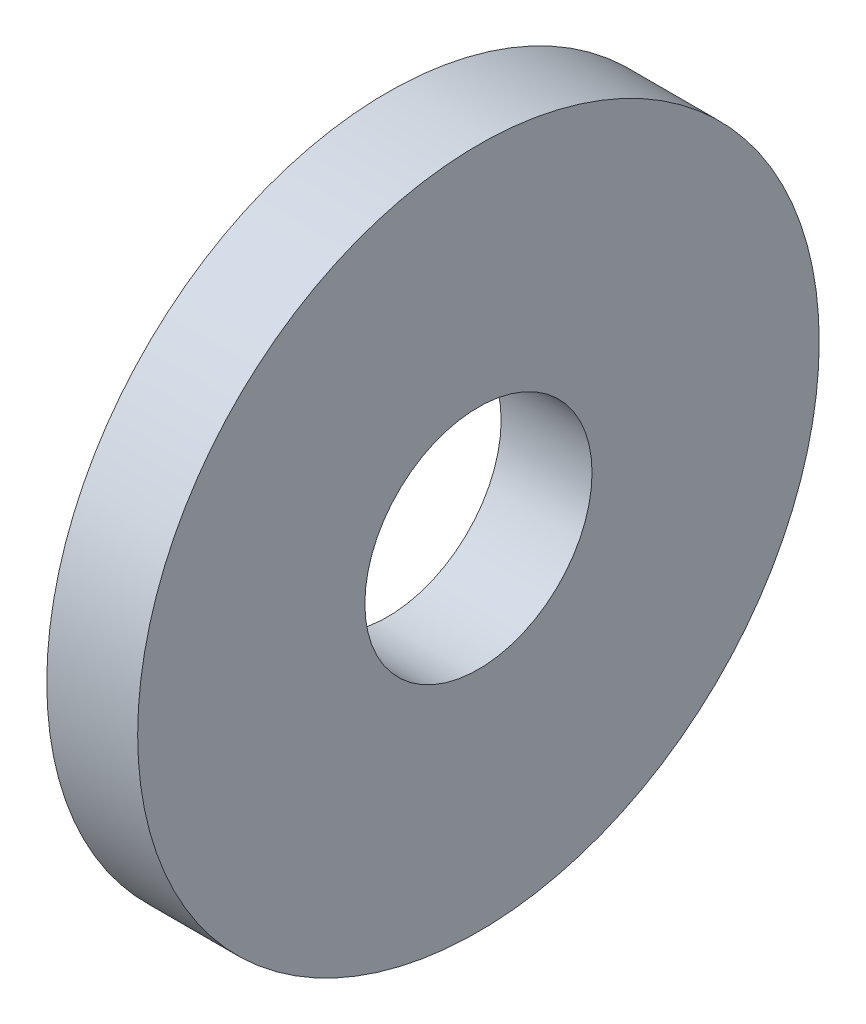
ISO-10303-21;
HEADER;
FILE_DESCRIPTION(('STEP AP214'),'2;1');
FILE_NAME('part.step','',(''),(''),'','','');
FILE_SCHEMA(('AUTOMOTIVE_DESIGN { 1 0 10303 214 1 1 1 1 }'));
ENDSEC;
DATA;
#1=APPLICATION_CONTEXT('core data for automotive mechanical design processes');
#2=APPLICATION_PROTOCOL_DEFINITION('international standard','automotive_design',2000,#1);
#3=PRODUCT_CONTEXT('',#1,'mechanical');
#4=PRODUCT('Part','Part','',(#3));
#5=PRODUCT_RELATED_PRODUCT_CATEGORY('part','',(#4));
#6=PRODUCT_DEFINITION_FORMATION('','',#4);
#7=PRODUCT_DEFINITION_CONTEXT('part definition',#1,'design');
#8=PRODUCT_DEFINITION('design','',#6,#7);
#9=PRODUCT_DEFINITION_SHAPE('','',#8);
#10=(LENGTH_UNIT() NAMED_UNIT(*) SI_UNIT(.MILLI.,.METRE.));
#11=(NAMED_UNIT(*) PLANE_ANGLE_UNIT() SI_UNIT($,.RADIAN.));
#12=(NAMED_UNIT(*) SI_UNIT($,.STERADIAN.) SOLID_ANGLE_UNIT());
#13=UNCERTAINTY_MEASURE_WITH_UNIT(LENGTH_MEASURE(1.E-05),#10,'distance_accuracy_value','');
#14=(GEOMETRIC_REPRESENTATION_CONTEXT(3) GLOBAL_UNCERTAINTY_ASSIGNED_CONTEXT((#13)) GLOBAL_UNIT_ASSIGNED_CONTEXT((#10,
#11,#12)) REPRESENTATION_CONTEXT('',''));
#15=CARTESIAN_POINT('',(0.,0.,0.));
#16=DIRECTION('',(0.,0.,1.));
#17=DIRECTION('',(1.,0.,0.));
#18=AXIS2_PLACEMENT_3D('',#15,#16,#17);
#19=CARTESIAN_POINT('',(4.,0.,0.));
#20=DIRECTION('',(1.,0.,0.));
#21=DIRECTION('',(0.,0.,-1.));
#22=AXIS2_PLACEMENT_3D('',#19,#20,#21);
#23=PLANE('',#22);
#24=CARTESIAN_POINT('',(4.,0.,0.));
#25=DIRECTION('',(1.,0.,0.));
#26=DIRECTION('',(0.,0.,-1.));
#27=AXIS2_PLACEMENT_3D('',#24,#25,#26);
#28=CIRCLE('',#27,15.);
#29=CARTESIAN_POINT('',(4.,0.,-15.));
#30=VERTEX_POINT('',#29);
#31=EDGE_CURVE('E10',#30,#30,#28,.T.);
#32=ORIENTED_EDGE('',*,*,#31,.T.);
#33=EDGE_LOOP('',(#32));
#34=FACE_BOUND('',#33,.T.);
#35=CARTESIAN_POINT('',(4.,0.,0.));
#36=DIRECTION('',(1.,0.,0.));
#37=DIRECTION('',(0.,0.,-1.));
#38=AXIS2_PLACEMENT_3D('',#35,#36,#37);
#39=CIRCLE('',#38,5.);
#40=CARTESIAN_POINT('',(4.,0.,-5.));
#41=VERTEX_POINT('',#40);
#42=EDGE_CURVE('E40',#41,#41,#39,.T.);
#43=ORIENTED_EDGE('',*,*,#42,.F.);
#44=EDGE_LOOP('',(#43));
#45=FACE_BOUND('',#44,.T.);
#46=ADVANCED_FACE('F29',(#34,#45),#23,.T.);
#47=CARTESIAN_POINT('',(0.,0.,0.));
#48=DIRECTION('',(1.,0.,0.));
#49=DIRECTION('',(0.,0.,-1.));
#50=AXIS2_PLACEMENT_3D('',#47,#48,#49);
#51=PLANE('',#50);
#52=CARTESIAN_POINT('',(0.,0.,0.));
#53=DIRECTION('',(1.,0.,0.));
#54=DIRECTION('',(0.,0.,-1.));
#55=AXIS2_PLACEMENT_3D('',#52,#53,#54);
#56=CIRCLE('',#55,15.);
#57=CARTESIAN_POINT('',(0.,0.,-15.));
#58=VERTEX_POINT('',#57);
#59=EDGE_CURVE('E33',#58,#58,#56,.T.);
#60=ORIENTED_EDGE('',*,*,#59,.F.);
#61=EDGE_LOOP('',(#60));
#62=FACE_BOUND('',#61,.T.);
#63=CARTESIAN_POINT('',(0.,0.,0.));
#64=DIRECTION('',(1.,0.,0.));
#65=DIRECTION('',(0.,0.,-1.));
#66=AXIS2_PLACEMENT_3D('',#63,#64,#65);
#67=CIRCLE('',#66,5.);
#68=CARTESIAN_POINT('',(0.,0.,-5.));
#69=VERTEX_POINT('',#68);
#70=EDGE_CURVE('E42',#69,#69,#67,.T.);
#71=ORIENTED_EDGE('',*,*,#70,.T.);
#72=EDGE_LOOP('',(#71));
#73=FACE_BOUND('',#72,.T.);
#74=ADVANCED_FACE('F52',(#62,#73),#51,.F.);
#75=CARTESIAN_POINT('',(4.,0.,0.));
#76=DIRECTION('',(-1.,0.,0.));
#77=DIRECTION('',(0.,0.,1.));
#78=AXIS2_PLACEMENT_3D('',#75,#76,#77);
#79=CYLINDRICAL_SURFACE('',#78,15.);
#80=ORIENTED_EDGE('',*,*,#31,.F.);
#81=EDGE_LOOP('',(#80));
#82=FACE_BOUND('',#81,.T.);
#83=ORIENTED_EDGE('',*,*,#59,.T.);
#84=EDGE_LOOP('',(#83));
#85=FACE_BOUND('',#84,.T.);
#86=ADVANCED_FACE('F31',(#82,#85),#79,.T.);
#87=CARTESIAN_POINT('',(4.,0.,0.));
#88=DIRECTION('',(-1.,0.,0.));
#89=DIRECTION('',(0.,0.,1.));
#90=AXIS2_PLACEMENT_3D('',#87,#88,#89);
#91=CYLINDRICAL_SURFACE('',#90,5.);
#92=ORIENTED_EDGE('',*,*,#42,.T.);
#93=EDGE_LOOP('',(#92));
#94=FACE_BOUND('',#93,.T.);
#95=ORIENTED_EDGE('',*,*,#70,.F.);
#96=EDGE_LOOP('',(#95));
#97=FACE_BOUND('',#96,.T.);
#98=ADVANCED_FACE('F48',(#94,#97),#91,.F.);
#99=CLOSED_SHELL('',(#46,#74,#86,#98));
#100=MANIFOLD_SOLID_BREP('B2',#99);
#101=ADVANCED_BREP_SHAPE_REPRESENTATION('',(#18,#100),#14);
#102=SHAPE_DEFINITION_REPRESENTATION(#9,#101);
ENDSEC;
END-ISO-10303-21;
